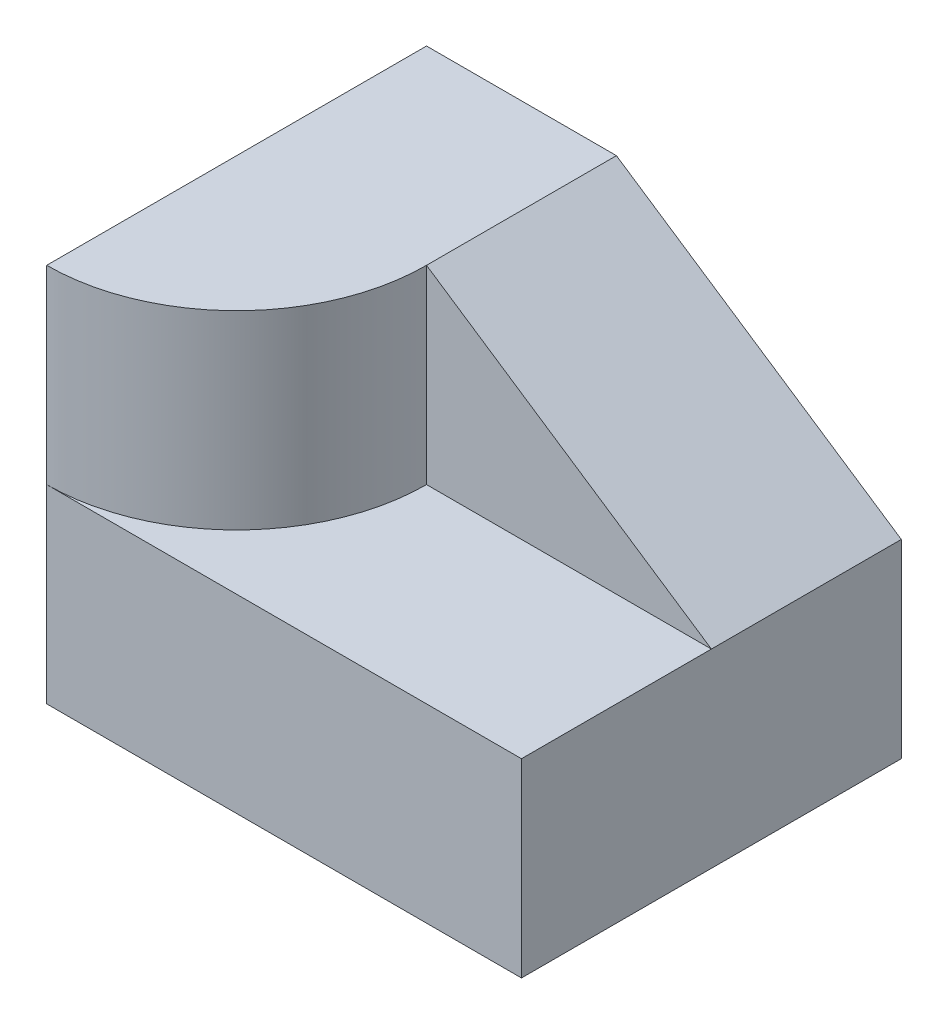
ISO-10303-21;
HEADER;
FILE_DESCRIPTION(('STEP AP214'),'2;1');
FILE_NAME('part.step','',(''),(''),'','','');
FILE_SCHEMA(('AUTOMOTIVE_DESIGN { 1 0 10303 214 1 1 1 1 }'));
ENDSEC;
DATA;
#1=APPLICATION_CONTEXT('core data for automotive mechanical design processes');
#2=APPLICATION_PROTOCOL_DEFINITION('international standard','automotive_design',2000,#1);
#3=PRODUCT_CONTEXT('',#1,'mechanical');
#4=PRODUCT('Part','Part','',(#3));
#5=PRODUCT_RELATED_PRODUCT_CATEGORY('part','',(#4));
#6=PRODUCT_DEFINITION_FORMATION('','',#4);
#7=PRODUCT_DEFINITION_CONTEXT('part definition',#1,'design');
#8=PRODUCT_DEFINITION('design','',#6,#7);
#9=PRODUCT_DEFINITION_SHAPE('','',#8);
#10=(LENGTH_UNIT() NAMED_UNIT(*) SI_UNIT(.MILLI.,.METRE.));
#11=(NAMED_UNIT(*) PLANE_ANGLE_UNIT() SI_UNIT($,.RADIAN.));
#12=(NAMED_UNIT(*) SI_UNIT($,.STERADIAN.) SOLID_ANGLE_UNIT());
#13=UNCERTAINTY_MEASURE_WITH_UNIT(LENGTH_MEASURE(1.E-05),#10,'distance_accuracy_value','');
#14=(GEOMETRIC_REPRESENTATION_CONTEXT(3) GLOBAL_UNCERTAINTY_ASSIGNED_CONTEXT((#13)) GLOBAL_UNIT_ASSIGNED_CONTEXT((#10,
#11,#12)) REPRESENTATION_CONTEXT('',''));
#15=CARTESIAN_POINT('',(0.,0.,0.));
#16=DIRECTION('',(0.,0.,1.));
#17=DIRECTION('',(1.,0.,0.));
#18=AXIS2_PLACEMENT_3D('',#15,#16,#17);
#19=CARTESIAN_POINT('',(-12.5,10.,0.));
#20=DIRECTION('',(-1.,0.,0.));
#21=DIRECTION('',(0.,0.,1.));
#22=AXIS2_PLACEMENT_3D('',#19,#20,#21);
#23=PLANE('',#22);
#24=DIRECTION('',(0.,0.,-1.));
#25=VECTOR('',#24,1.);
#26=CARTESIAN_POINT('',(-12.5,0.,0.));
#27=LINE('',#26,#25);
#28=CARTESIAN_POINT('',(-12.5,0.,10.));
#29=VERTEX_POINT('',#28);
#30=CARTESIAN_POINT('',(-12.5,0.,-10.));
#31=VERTEX_POINT('',#30);
#32=EDGE_CURVE('E104',#29,#31,#27,.T.);
#33=ORIENTED_EDGE('',*,*,#32,.F.);
#34=DIRECTION('',(0.,-1.,0.));
#35=VECTOR('',#34,1.);
#36=CARTESIAN_POINT('',(-12.5,10.,10.));
#37=LINE('',#36,#35);
#38=CARTESIAN_POINT('',(-12.5,10.,10.));
#39=VERTEX_POINT('',#38);
#40=EDGE_CURVE('E46',#39,#29,#37,.T.);
#41=ORIENTED_EDGE('',*,*,#40,.F.);
#42=DIRECTION('',(0.,-1.,0.));
#43=VECTOR('',#42,1.);
#44=CARTESIAN_POINT('',(-12.5,20.,10.));
#45=LINE('',#44,#43);
#46=CARTESIAN_POINT('',(-12.5,20.,10.));
#47=VERTEX_POINT('',#46);
#48=EDGE_CURVE('E130',#47,#39,#45,.T.);
#49=ORIENTED_EDGE('',*,*,#48,.F.);
#50=DIRECTION('',(0.,0.,-1.));
#51=VECTOR('',#50,1.);
#52=CARTESIAN_POINT('',(-12.5,20.,0.));
#53=LINE('',#52,#51);
#54=CARTESIAN_POINT('',(-12.5,20.,-10.));
#55=VERTEX_POINT('',#54);
#56=EDGE_CURVE('E133',#47,#55,#53,.T.);
#57=ORIENTED_EDGE('',*,*,#56,.T.);
#58=DIRECTION('',(0.,-1.,0.));
#59=VECTOR('',#58,1.);
#60=CARTESIAN_POINT('',(-12.5,10.,-10.));
#61=LINE('',#60,#59);
#62=EDGE_CURVE('E90',#55,#31,#61,.T.);
#63=ORIENTED_EDGE('',*,*,#62,.T.);
#64=EDGE_LOOP('',(#33,#41,#49,#57,#63));
#65=FACE_BOUND('',#64,.T.);
#66=ADVANCED_FACE('F39',(#65),#23,.T.);
#67=CARTESIAN_POINT('',(0.,10.,10.));
#68=DIRECTION('',(0.,0.,-1.));
#69=DIRECTION('',(-1.,0.,0.));
#70=AXIS2_PLACEMENT_3D('',#67,#68,#69);
#71=PLANE('',#70);
#72=DIRECTION('',(1.,0.,0.));
#73=VECTOR('',#72,1.);
#74=CARTESIAN_POINT('',(0.,0.,10.));
#75=LINE('',#74,#73);
#76=CARTESIAN_POINT('',(12.5,0.,10.));
#77=VERTEX_POINT('',#76);
#78=EDGE_CURVE('E99',#29,#77,#75,.T.);
#79=ORIENTED_EDGE('',*,*,#78,.T.);
#80=DIRECTION('',(0.,-1.,0.));
#81=VECTOR('',#80,1.);
#82=CARTESIAN_POINT('',(12.5,10.,10.));
#83=LINE('',#82,#81);
#84=CARTESIAN_POINT('',(12.5,10.,10.));
#85=VERTEX_POINT('',#84);
#86=EDGE_CURVE('E89',#85,#77,#83,.T.);
#87=ORIENTED_EDGE('',*,*,#86,.F.);
#88=DIRECTION('',(1.,0.,0.));
#89=VECTOR('',#88,1.);
#90=CARTESIAN_POINT('',(0.,10.,10.));
#91=LINE('',#90,#89);
#92=EDGE_CURVE('E61',#39,#85,#91,.T.);
#93=ORIENTED_EDGE('',*,*,#92,.F.);
#94=ORIENTED_EDGE('',*,*,#40,.T.);
#95=EDGE_LOOP('',(#79,#87,#93,#94));
#96=FACE_BOUND('',#95,.T.);
#97=ADVANCED_FACE('F113',(#96),#71,.F.);
#98=CARTESIAN_POINT('',(12.5,10.,0.));
#99=DIRECTION('',(-1.,0.,0.));
#100=DIRECTION('',(0.,0.,1.));
#101=AXIS2_PLACEMENT_3D('',#98,#99,#100);
#102=PLANE('',#101);
#103=DIRECTION('',(0.,-1.,0.));
#104=VECTOR('',#103,1.);
#105=CARTESIAN_POINT('',(12.5,10.,-10.));
#106=LINE('',#105,#104);
#107=CARTESIAN_POINT('',(12.5,10.,-10.));
#108=VERTEX_POINT('',#107);
#109=CARTESIAN_POINT('',(12.5,0.,-10.));
#110=VERTEX_POINT('',#109);
#111=EDGE_CURVE('E79',#108,#110,#106,.T.);
#112=ORIENTED_EDGE('',*,*,#111,.F.);
#113=DIRECTION('',(0.,0.,1.));
#114=VECTOR('',#113,1.);
#115=CARTESIAN_POINT('',(12.5,10.,-20.));
#116=LINE('',#115,#114);
#117=CARTESIAN_POINT('',(12.5,10.,0.));
#118=VERTEX_POINT('',#117);
#119=EDGE_CURVE('E141',#108,#118,#116,.T.);
#120=ORIENTED_EDGE('',*,*,#119,.T.);
#121=DIRECTION('',(0.,0.,-1.));
#122=VECTOR('',#121,1.);
#123=CARTESIAN_POINT('',(12.5,10.,0.));
#124=LINE('',#123,#122);
#125=EDGE_CURVE('E106',#85,#118,#124,.T.);
#126=ORIENTED_EDGE('',*,*,#125,.F.);
#127=ORIENTED_EDGE('',*,*,#86,.T.);
#128=DIRECTION('',(0.,0.,-1.));
#129=VECTOR('',#128,1.);
#130=CARTESIAN_POINT('',(12.5,0.,0.));
#131=LINE('',#130,#129);
#132=EDGE_CURVE('E94',#77,#110,#131,.T.);
#133=ORIENTED_EDGE('',*,*,#132,.T.);
#134=EDGE_LOOP('',(#112,#120,#126,#127,#133));
#135=FACE_BOUND('',#134,.T.);
#136=ADVANCED_FACE('F95',(#135),#102,.F.);
#137=CARTESIAN_POINT('',(0.,10.,-10.));
#138=DIRECTION('',(0.,0.,-1.));
#139=DIRECTION('',(-1.,0.,0.));
#140=AXIS2_PLACEMENT_3D('',#137,#138,#139);
#141=PLANE('',#140);
#142=DIRECTION('',(-0.832050294337844,0.554700196225229,0.));
#143=VECTOR('',#142,1.);
#144=CARTESIAN_POINT('',(3.84615384615385,15.7692307692308,-10.));
#145=LINE('',#144,#143);
#146=CARTESIAN_POINT('',(-2.5,20.,-10.));
#147=VERTEX_POINT('',#146);
#148=EDGE_CURVE('E52',#108,#147,#145,.T.);
#149=ORIENTED_EDGE('',*,*,#148,.F.);
#150=ORIENTED_EDGE('',*,*,#111,.T.);
#151=DIRECTION('',(1.,0.,0.));
#152=VECTOR('',#151,1.);
#153=CARTESIAN_POINT('',(0.,0.,-10.));
#154=LINE('',#153,#152);
#155=EDGE_CURVE('E84',#31,#110,#154,.T.);
#156=ORIENTED_EDGE('',*,*,#155,.F.);
#157=ORIENTED_EDGE('',*,*,#62,.F.);
#158=DIRECTION('',(1.,0.,0.));
#159=VECTOR('',#158,1.);
#160=CARTESIAN_POINT('',(0.,20.,-10.));
#161=LINE('',#160,#159);
#162=EDGE_CURVE('E135',#55,#147,#161,.T.);
#163=ORIENTED_EDGE('',*,*,#162,.T.);
#164=EDGE_LOOP('',(#149,#150,#156,#157,#163));
#165=FACE_BOUND('',#164,.T.);
#166=ADVANCED_FACE('F81',(#165),#141,.T.);
#167=CARTESIAN_POINT('',(0.,10.,0.));
#168=DIRECTION('',(0.,1.,0.));
#169=DIRECTION('',(0.,0.,1.));
#170=AXIS2_PLACEMENT_3D('',#167,#168,#169);
#171=PLANE('',#170);
#172=CARTESIAN_POINT('',(-12.5,10.,0.));
#173=DIRECTION('',(0.,1.,0.));
#174=DIRECTION('',(0.,0.,1.));
#175=AXIS2_PLACEMENT_3D('',#172,#173,#174);
#176=CIRCLE('',#175,10.);
#177=CARTESIAN_POINT('',(-2.5,10.,0.));
#178=VERTEX_POINT('',#177);
#179=EDGE_CURVE('E118',#39,#178,#176,.T.);
#180=ORIENTED_EDGE('',*,*,#179,.F.);
#181=ORIENTED_EDGE('',*,*,#92,.T.);
#182=ORIENTED_EDGE('',*,*,#125,.T.);
#183=DIRECTION('',(1.,0.,0.));
#184=VECTOR('',#183,1.);
#185=CARTESIAN_POINT('',(0.,10.,0.));
#186=LINE('',#185,#184);
#187=EDGE_CURVE('E121',#178,#118,#186,.T.);
#188=ORIENTED_EDGE('',*,*,#187,.F.);
#189=EDGE_LOOP('',(#180,#181,#182,#188));
#190=FACE_BOUND('',#189,.T.);
#191=ADVANCED_FACE('F154',(#190),#171,.T.);
#192=CARTESIAN_POINT('',(0.,0.,0.));
#193=DIRECTION('',(0.,1.,0.));
#194=DIRECTION('',(0.,0.,1.));
#195=AXIS2_PLACEMENT_3D('',#192,#193,#194);
#196=PLANE('',#195);
#197=ORIENTED_EDGE('',*,*,#78,.F.);
#198=ORIENTED_EDGE('',*,*,#32,.T.);
#199=ORIENTED_EDGE('',*,*,#155,.T.);
#200=ORIENTED_EDGE('',*,*,#132,.F.);
#201=EDGE_LOOP('',(#197,#198,#199,#200));
#202=FACE_BOUND('',#201,.T.);
#203=ADVANCED_FACE('F102',(#202),#196,.F.);
#204=CARTESIAN_POINT('',(-12.5,20.,0.));
#205=DIRECTION('',(0.,-1.,0.));
#206=DIRECTION('',(0.,0.,-1.));
#207=AXIS2_PLACEMENT_3D('',#204,#205,#206);
#208=CYLINDRICAL_SURFACE('',#207,10.);
#209=ORIENTED_EDGE('',*,*,#48,.T.);
#210=ORIENTED_EDGE('',*,*,#179,.T.);
#211=DIRECTION('',(0.,-1.,0.));
#212=VECTOR('',#211,1.);
#213=CARTESIAN_POINT('',(-2.5,20.,0.));
#214=LINE('',#213,#212);
#215=CARTESIAN_POINT('',(-2.5,20.,0.));
#216=VERTEX_POINT('',#215);
#217=EDGE_CURVE('E127',#216,#178,#214,.T.);
#218=ORIENTED_EDGE('',*,*,#217,.F.);
#219=CARTESIAN_POINT('',(-12.5,20.,0.));
#220=DIRECTION('',(0.,1.,0.));
#221=DIRECTION('',(0.,0.,1.));
#222=AXIS2_PLACEMENT_3D('',#219,#220,#221);
#223=CIRCLE('',#222,10.);
#224=EDGE_CURVE('E137',#216,#47,#223,.F.);
#225=ORIENTED_EDGE('',*,*,#224,.T.);
#226=EDGE_LOOP('',(#209,#210,#218,#225));
#227=FACE_BOUND('',#226,.T.);
#228=ADVANCED_FACE('F161',(#227),#208,.T.);
#229=CARTESIAN_POINT('',(0.,20.,0.));
#230=DIRECTION('',(0.,0.,1.));
#231=DIRECTION('',(1.,0.,0.));
#232=AXIS2_PLACEMENT_3D('',#229,#230,#231);
#233=PLANE('',#232);
#234=DIRECTION('',(0.832050294337844,-0.554700196225229,0.));
#235=VECTOR('',#234,1.);
#236=CARTESIAN_POINT('',(-2.5,20.,0.));
#237=LINE('',#236,#235);
#238=EDGE_CURVE('E143',#216,#118,#237,.T.);
#239=ORIENTED_EDGE('',*,*,#238,.F.);
#240=ORIENTED_EDGE('',*,*,#217,.T.);
#241=ORIENTED_EDGE('',*,*,#187,.T.);
#242=EDGE_LOOP('',(#239,#240,#241));
#243=FACE_BOUND('',#242,.T.);
#244=ADVANCED_FACE('F153',(#243),#233,.T.);
#245=CARTESIAN_POINT('',(0.,20.,0.));
#246=DIRECTION('',(0.,1.,0.));
#247=DIRECTION('',(0.,0.,1.));
#248=AXIS2_PLACEMENT_3D('',#245,#246,#247);
#249=PLANE('',#248);
#250=DIRECTION('',(0.,0.,1.));
#251=VECTOR('',#250,1.);
#252=CARTESIAN_POINT('',(-2.5,20.,0.));
#253=LINE('',#252,#251);
#254=EDGE_CURVE('E11',#147,#216,#253,.T.);
#255=ORIENTED_EDGE('',*,*,#254,.F.);
#256=ORIENTED_EDGE('',*,*,#162,.F.);
#257=ORIENTED_EDGE('',*,*,#56,.F.);
#258=ORIENTED_EDGE('',*,*,#224,.F.);
#259=EDGE_LOOP('',(#255,#256,#257,#258));
#260=FACE_BOUND('',#259,.T.);
#261=ADVANCED_FACE('F204',(#260),#249,.T.);
#262=CARTESIAN_POINT('',(-2.5,20.,-20.));
#263=DIRECTION('',(-0.554700196225229,-0.832050294337844,0.));
#264=DIRECTION('',(0.832050294337844,-0.554700196225229,0.));
#265=AXIS2_PLACEMENT_3D('',#262,#263,#264);
#266=PLANE('',#265);
#267=ORIENTED_EDGE('',*,*,#148,.T.);
#268=ORIENTED_EDGE('',*,*,#254,.T.);
#269=ORIENTED_EDGE('',*,*,#238,.T.);
#270=ORIENTED_EDGE('',*,*,#119,.F.);
#271=EDGE_LOOP('',(#267,#268,#269,#270));
#272=FACE_BOUND('',#271,.T.);
#273=ADVANCED_FACE('F147',(#272),#266,.F.);
#274=CLOSED_SHELL('',(#66,#97,#136,#166,#191,#203,#228,#244,#261,#273));
#275=MANIFOLD_SOLID_BREP('B2',#274);
#276=ADVANCED_BREP_SHAPE_REPRESENTATION('',(#18,#275),#14);
#277=SHAPE_DEFINITION_REPRESENTATION(#9,#276);
ENDSEC;
END-ISO-10303-21;
